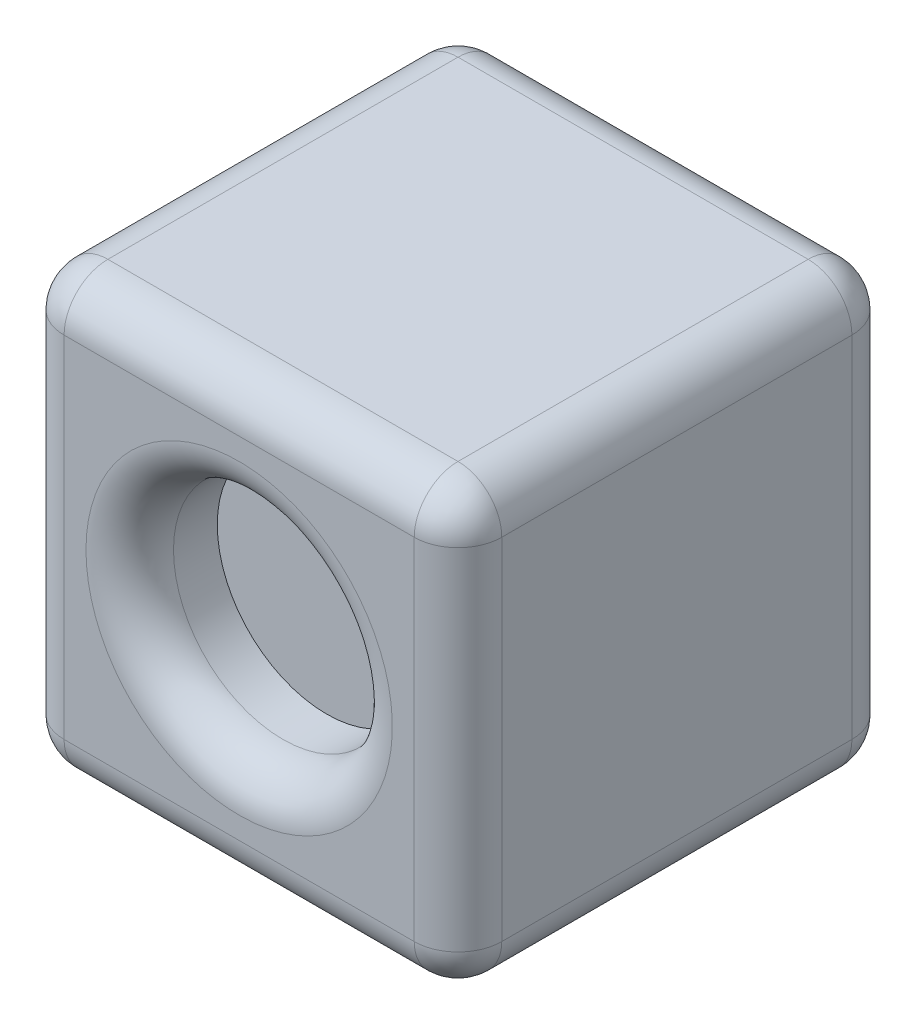
ISO-10303-21;
HEADER;
FILE_DESCRIPTION(('STEP AP214'),'2;1');
FILE_NAME('part.step','',(''),(''),'','','');
FILE_SCHEMA(('AUTOMOTIVE_DESIGN { 1 0 10303 214 1 1 1 1 }'));
ENDSEC;
DATA;
#1=APPLICATION_CONTEXT('core data for automotive mechanical design processes');
#2=APPLICATION_PROTOCOL_DEFINITION('international standard','automotive_design',2000,#1);
#3=PRODUCT_CONTEXT('',#1,'mechanical');
#4=PRODUCT('Part','Part','',(#3));
#5=PRODUCT_RELATED_PRODUCT_CATEGORY('part','',(#4));
#6=PRODUCT_DEFINITION_FORMATION('','',#4);
#7=PRODUCT_DEFINITION_CONTEXT('part definition',#1,'design');
#8=PRODUCT_DEFINITION('design','',#6,#7);
#9=PRODUCT_DEFINITION_SHAPE('','',#8);
#10=(LENGTH_UNIT() NAMED_UNIT(*) SI_UNIT(.MILLI.,.METRE.));
#11=(NAMED_UNIT(*) PLANE_ANGLE_UNIT() SI_UNIT($,.RADIAN.));
#12=(NAMED_UNIT(*) SI_UNIT($,.STERADIAN.) SOLID_ANGLE_UNIT());
#13=UNCERTAINTY_MEASURE_WITH_UNIT(LENGTH_MEASURE(1.E-05),#10,'distance_accuracy_value','');
#14=(GEOMETRIC_REPRESENTATION_CONTEXT(3) GLOBAL_UNCERTAINTY_ASSIGNED_CONTEXT((#13)) GLOBAL_UNIT_ASSIGNED_CONTEXT((#10,
#11,#12)) REPRESENTATION_CONTEXT('',''));
#15=CARTESIAN_POINT('',(0.,0.,0.));
#16=DIRECTION('',(0.,0.,1.));
#17=DIRECTION('',(1.,0.,0.));
#18=AXIS2_PLACEMENT_3D('',#15,#16,#17);
#19=CARTESIAN_POINT('',(50.,-50.,100.));
#20=DIRECTION('',(-1.,0.,0.));
#21=DIRECTION('',(0.,0.,1.));
#22=AXIS2_PLACEMENT_3D('',#19,#20,#21);
#23=PLANE('',#22);
#24=DIRECTION('',(0.,0.,-1.));
#25=VECTOR('',#24,1.);
#26=CARTESIAN_POINT('',(50.,-40.,100.));
#27=LINE('',#26,#25);
#28=CARTESIAN_POINT('',(50.,-40.,90.));
#29=VERTEX_POINT('',#28);
#30=CARTESIAN_POINT('',(50.,-40.,9.99999999999999));
#31=VERTEX_POINT('',#30);
#32=EDGE_CURVE('E363',#29,#31,#27,.T.);
#33=ORIENTED_EDGE('',*,*,#32,.T.);
#34=DIRECTION('',(0.,1.,0.));
#35=VECTOR('',#34,1.);
#36=CARTESIAN_POINT('',(50.,50.,9.99999999999999));
#37=LINE('',#36,#35);
#38=CARTESIAN_POINT('',(50.,40.,9.99999999999999));
#39=VERTEX_POINT('',#38);
#40=EDGE_CURVE('E443',#31,#39,#37,.T.);
#41=ORIENTED_EDGE('',*,*,#40,.T.);
#42=DIRECTION('',(0.,0.,-1.));
#43=VECTOR('',#42,1.);
#44=CARTESIAN_POINT('',(50.,40.,100.));
#45=LINE('',#44,#43);
#46=CARTESIAN_POINT('',(50.,40.,90.));
#47=VERTEX_POINT('',#46);
#48=EDGE_CURVE('E440',#39,#47,#45,.F.);
#49=ORIENTED_EDGE('',*,*,#48,.T.);
#50=DIRECTION('',(0.,1.,0.));
#51=VECTOR('',#50,1.);
#52=CARTESIAN_POINT('',(50.,-50.,90.));
#53=LINE('',#52,#51);
#54=EDGE_CURVE('E437',#47,#29,#53,.F.);
#55=ORIENTED_EDGE('',*,*,#54,.T.);
#56=EDGE_LOOP('',(#33,#41,#49,#55));
#57=FACE_BOUND('',#56,.T.);
#58=ADVANCED_FACE('F46',(#57),#23,.F.);
#59=CARTESIAN_POINT('',(-50.,50.,100.));
#60=DIRECTION('',(0.,-1.,0.));
#61=DIRECTION('',(0.,0.,-1.));
#62=AXIS2_PLACEMENT_3D('',#59,#60,#61);
#63=PLANE('',#62);
#64=DIRECTION('',(0.,0.,-1.));
#65=VECTOR('',#64,1.);
#66=CARTESIAN_POINT('',(40.,50.,100.));
#67=LINE('',#66,#65);
#68=CARTESIAN_POINT('',(40.,50.,90.));
#69=VERTEX_POINT('',#68);
#70=CARTESIAN_POINT('',(40.,50.,9.99999999999999));
#71=VERTEX_POINT('',#70);
#72=EDGE_CURVE('E453',#69,#71,#67,.T.);
#73=ORIENTED_EDGE('',*,*,#72,.T.);
#74=DIRECTION('',(-1.,0.,0.));
#75=VECTOR('',#74,1.);
#76=CARTESIAN_POINT('',(-40.,50.,9.99999999999999));
#77=LINE('',#76,#75);
#78=CARTESIAN_POINT('',(-40.,50.,9.99999999999999));
#79=VERTEX_POINT('',#78);
#80=EDGE_CURVE('E456',#71,#79,#77,.T.);
#81=ORIENTED_EDGE('',*,*,#80,.T.);
#82=DIRECTION('',(0.,0.,-1.));
#83=VECTOR('',#82,1.);
#84=CARTESIAN_POINT('',(-40.,50.,100.));
#85=LINE('',#84,#83);
#86=CARTESIAN_POINT('',(-40.,50.,90.));
#87=VERTEX_POINT('',#86);
#88=EDGE_CURVE('E345',#79,#87,#85,.F.);
#89=ORIENTED_EDGE('',*,*,#88,.T.);
#90=DIRECTION('',(-1.,0.,0.));
#91=VECTOR('',#90,1.);
#92=CARTESIAN_POINT('',(-50.,50.,90.));
#93=LINE('',#92,#91);
#94=EDGE_CURVE('E341',#87,#69,#93,.F.);
#95=ORIENTED_EDGE('',*,*,#94,.T.);
#96=EDGE_LOOP('',(#73,#81,#89,#95));
#97=FACE_BOUND('',#96,.T.);
#98=ADVANCED_FACE('F578',(#97),#63,.F.);
#99=CARTESIAN_POINT('',(-50.,-50.,100.));
#100=DIRECTION('',(1.,0.,0.));
#101=DIRECTION('',(0.,0.,-1.));
#102=AXIS2_PLACEMENT_3D('',#99,#100,#101);
#103=PLANE('',#102);
#104=DIRECTION('',(0.,-1.,0.));
#105=VECTOR('',#104,1.);
#106=CARTESIAN_POINT('',(-50.,-50.,80.9807621135332));
#107=LINE('',#106,#105);
#108=CARTESIAN_POINT('',(-50.,17.8867513459482,80.9807621135332));
#109=VERTEX_POINT('',#108);
#110=CARTESIAN_POINT('',(-50.,-17.8867513459482,80.9807621135332));
#111=VERTEX_POINT('',#110);
#112=EDGE_CURVE('E272',#109,#111,#107,.T.);
#113=ORIENTED_EDGE('',*,*,#112,.T.);
#114=DIRECTION('',(0.,-0.500000000000001,-0.866025403784438));
#115=VECTOR('',#114,1.);
#116=CARTESIAN_POINT('',(-50.,-17.6794919243113,81.3397459621556));
#117=LINE('',#116,#115);
#118=CARTESIAN_POINT('',(-50.,-35.7735026918963,50.));
#119=VERTEX_POINT('',#118);
#120=EDGE_CURVE('E287',#111,#119,#117,.T.);
#121=ORIENTED_EDGE('',*,*,#120,.T.);
#122=DIRECTION('',(0.,0.5,-0.866025403784439));
#123=VECTOR('',#122,1.);
#124=CARTESIAN_POINT('',(-50.,-60.9807621135332,93.6602540378444));
#125=LINE('',#124,#123);
#126=CARTESIAN_POINT('',(-50.,-17.8867513459482,19.0192378864668));
#127=VERTEX_POINT('',#126);
#128=EDGE_CURVE('E284',#119,#127,#125,.T.);
#129=ORIENTED_EDGE('',*,*,#128,.T.);
#130=DIRECTION('',(0.,1.,0.));
#131=VECTOR('',#130,1.);
#132=CARTESIAN_POINT('',(-50.,-50.,19.0192378864668));
#133=LINE('',#132,#131);
#134=CARTESIAN_POINT('',(-50.,17.8867513459482,19.0192378864668));
#135=VERTEX_POINT('',#134);
#136=EDGE_CURVE('E281',#127,#135,#133,.T.);
#137=ORIENTED_EDGE('',*,*,#136,.T.);
#138=DIRECTION('',(0.,0.5,0.866025403784439));
#139=VECTOR('',#138,1.);
#140=CARTESIAN_POINT('',(-50.,35.9807621135332,50.3589838486224));
#141=LINE('',#140,#139);
#142=CARTESIAN_POINT('',(-50.,35.7735026918963,50.));
#143=VERTEX_POINT('',#142);
#144=EDGE_CURVE('E278',#135,#143,#141,.T.);
#145=ORIENTED_EDGE('',*,*,#144,.T.);
#146=DIRECTION('',(0.,-0.499999999999999,0.866025403784439));
#147=VECTOR('',#146,1.);
#148=CARTESIAN_POINT('',(-50.,-7.32050807568863,124.641016151378));
#149=LINE('',#148,#147);
#150=EDGE_CURVE('E275',#143,#109,#149,.T.);
#151=ORIENTED_EDGE('',*,*,#150,.T.);
#152=EDGE_LOOP('',(#113,#121,#129,#137,#145,#151));
#153=FACE_BOUND('',#152,.T.);
#154=DIRECTION('',(0.,0.,-1.));
#155=VECTOR('',#154,1.);
#156=CARTESIAN_POINT('',(-50.,40.,100.));
#157=LINE('',#156,#155);
#158=CARTESIAN_POINT('',(-50.,40.,90.));
#159=VERTEX_POINT('',#158);
#160=CARTESIAN_POINT('',(-50.,40.,9.99999999999999));
#161=VERTEX_POINT('',#160);
#162=EDGE_CURVE('E333',#159,#161,#157,.T.);
#163=ORIENTED_EDGE('',*,*,#162,.T.);
#164=DIRECTION('',(0.,-1.,0.));
#165=VECTOR('',#164,1.);
#166=CARTESIAN_POINT('',(-50.,-40.,9.99999999999999));
#167=LINE('',#166,#165);
#168=CARTESIAN_POINT('',(-50.,-40.,9.99999999999999));
#169=VERTEX_POINT('',#168);
#170=EDGE_CURVE('E416',#161,#169,#167,.T.);
#171=ORIENTED_EDGE('',*,*,#170,.T.);
#172=DIRECTION('',(0.,0.,-1.));
#173=VECTOR('',#172,1.);
#174=CARTESIAN_POINT('',(-50.,-40.,100.));
#175=LINE('',#174,#173);
#176=CARTESIAN_POINT('',(-50.,-40.,90.));
#177=VERTEX_POINT('',#176);
#178=EDGE_CURVE('E327',#169,#177,#175,.F.);
#179=ORIENTED_EDGE('',*,*,#178,.T.);
#180=DIRECTION('',(0.,-1.,0.));
#181=VECTOR('',#180,1.);
#182=CARTESIAN_POINT('',(-50.,-50.,90.));
#183=LINE('',#182,#181);
#184=EDGE_CURVE('E330',#177,#159,#183,.F.);
#185=ORIENTED_EDGE('',*,*,#184,.T.);
#186=EDGE_LOOP('',(#163,#171,#179,#185));
#187=FACE_BOUND('',#186,.T.);
#188=ADVANCED_FACE('F603',(#153,#187),#103,.F.);
#189=CARTESIAN_POINT('',(-50.,-50.,100.));
#190=DIRECTION('',(0.,1.,0.));
#191=DIRECTION('',(0.,0.,1.));
#192=AXIS2_PLACEMENT_3D('',#189,#190,#191);
#193=PLANE('',#192);
#194=DIRECTION('',(0.,0.,-1.));
#195=VECTOR('',#194,1.);
#196=CARTESIAN_POINT('',(-40.,-50.,100.));
#197=LINE('',#196,#195);
#198=CARTESIAN_POINT('',(-40.,-50.,90.));
#199=VERTEX_POINT('',#198);
#200=CARTESIAN_POINT('',(-40.,-50.,9.99999999999999));
#201=VERTEX_POINT('',#200);
#202=EDGE_CURVE('E348',#199,#201,#197,.T.);
#203=ORIENTED_EDGE('',*,*,#202,.T.);
#204=DIRECTION('',(1.,0.,0.));
#205=VECTOR('',#204,1.);
#206=CARTESIAN_POINT('',(50.,-50.,9.99999999999999));
#207=LINE('',#206,#205);
#208=CARTESIAN_POINT('',(40.,-50.,9.99999999999999));
#209=VERTEX_POINT('',#208);
#210=EDGE_CURVE('E359',#201,#209,#207,.T.);
#211=ORIENTED_EDGE('',*,*,#210,.T.);
#212=DIRECTION('',(0.,0.,-1.));
#213=VECTOR('',#212,1.);
#214=CARTESIAN_POINT('',(40.,-50.,100.));
#215=LINE('',#214,#213);
#216=CARTESIAN_POINT('',(40.,-50.,90.));
#217=VERTEX_POINT('',#216);
#218=EDGE_CURVE('E355',#209,#217,#215,.F.);
#219=ORIENTED_EDGE('',*,*,#218,.T.);
#220=DIRECTION('',(1.,0.,0.));
#221=VECTOR('',#220,1.);
#222=CARTESIAN_POINT('',(-50.,-50.,90.));
#223=LINE('',#222,#221);
#224=EDGE_CURVE('E352',#217,#199,#223,.F.);
#225=ORIENTED_EDGE('',*,*,#224,.T.);
#226=EDGE_LOOP('',(#203,#211,#219,#225));
#227=FACE_BOUND('',#226,.T.);
#228=ADVANCED_FACE('F526',(#227),#193,.F.);
#229=CARTESIAN_POINT('',(0.,0.,100.));
#230=DIRECTION('',(0.,0.,-1.));
#231=DIRECTION('',(-1.,0.,0.));
#232=AXIS2_PLACEMENT_3D('',#229,#230,#231);
#233=PLANE('',#232);
#234=CARTESIAN_POINT('',(0.,0.,100.));
#235=DIRECTION('',(0.,0.,-1.));
#236=DIRECTION('',(-1.,0.,0.));
#237=AXIS2_PLACEMENT_3D('',#234,#235,#236);
#238=CIRCLE('',#237,35.);
#239=CARTESIAN_POINT('',(-35.,0.,100.));
#240=VERTEX_POINT('',#239);
#241=EDGE_CURVE('E323',#240,#240,#238,.T.);
#242=ORIENTED_EDGE('',*,*,#241,.T.);
#243=EDGE_LOOP('',(#242));
#244=FACE_BOUND('',#243,.T.);
#245=DIRECTION('',(1.,0.,0.));
#246=VECTOR('',#245,1.);
#247=CARTESIAN_POINT('',(0.,-40.,100.));
#248=LINE('',#247,#246);
#249=CARTESIAN_POINT('',(-40.,-40.,100.));
#250=VERTEX_POINT('',#249);
#251=CARTESIAN_POINT('',(40.,-40.,100.));
#252=VERTEX_POINT('',#251);
#253=EDGE_CURVE('E367',#250,#252,#248,.T.);
#254=ORIENTED_EDGE('',*,*,#253,.T.);
#255=DIRECTION('',(0.,1.,0.));
#256=VECTOR('',#255,1.);
#257=CARTESIAN_POINT('',(40.,0.,100.));
#258=LINE('',#257,#256);
#259=CARTESIAN_POINT('',(40.,40.,100.));
#260=VERTEX_POINT('',#259);
#261=EDGE_CURVE('E459',#252,#260,#258,.T.);
#262=ORIENTED_EDGE('',*,*,#261,.T.);
#263=DIRECTION('',(-1.,0.,0.));
#264=VECTOR('',#263,1.);
#265=CARTESIAN_POINT('',(0.,40.,100.));
#266=LINE('',#265,#264);
#267=CARTESIAN_POINT('',(-40.,40.,100.));
#268=VERTEX_POINT('',#267);
#269=EDGE_CURVE('E374',#260,#268,#266,.T.);
#270=ORIENTED_EDGE('',*,*,#269,.T.);
#271=DIRECTION('',(0.,-1.,0.));
#272=VECTOR('',#271,1.);
#273=CARTESIAN_POINT('',(-40.,0.,100.));
#274=LINE('',#273,#272);
#275=EDGE_CURVE('E371',#268,#250,#274,.T.);
#276=ORIENTED_EDGE('',*,*,#275,.T.);
#277=EDGE_LOOP('',(#254,#262,#270,#276));
#278=FACE_BOUND('',#277,.T.);
#279=ADVANCED_FACE('F1003',(#244,#278),#233,.F.);
#280=CARTESIAN_POINT('',(0.,0.,0.));
#281=DIRECTION('',(0.,0.,-1.));
#282=DIRECTION('',(-1.,0.,0.));
#283=AXIS2_PLACEMENT_3D('',#280,#281,#282);
#284=PLANE('',#283);
#285=DIRECTION('',(1.,0.,0.));
#286=VECTOR('',#285,1.);
#287=CARTESIAN_POINT('',(-50.,-40.,0.));
#288=LINE('',#287,#286);
#289=CARTESIAN_POINT('',(40.,-40.,0.));
#290=VERTEX_POINT('',#289);
#291=CARTESIAN_POINT('',(-40.,-40.,0.));
#292=VERTEX_POINT('',#291);
#293=EDGE_CURVE('E337',#290,#292,#288,.F.);
#294=ORIENTED_EDGE('',*,*,#293,.T.);
#295=DIRECTION('',(0.,-1.,0.));
#296=VECTOR('',#295,1.);
#297=CARTESIAN_POINT('',(-40.,40.,0.));
#298=LINE('',#297,#296);
#299=CARTESIAN_POINT('',(-40.,40.,0.));
#300=VERTEX_POINT('',#299);
#301=EDGE_CURVE('E425',#292,#300,#298,.F.);
#302=ORIENTED_EDGE('',*,*,#301,.T.);
#303=DIRECTION('',(-1.,0.,0.));
#304=VECTOR('',#303,1.);
#305=CARTESIAN_POINT('',(50.,40.,0.));
#306=LINE('',#305,#304);
#307=CARTESIAN_POINT('',(40.,40.,0.));
#308=VERTEX_POINT('',#307);
#309=EDGE_CURVE('E419',#300,#308,#306,.F.);
#310=ORIENTED_EDGE('',*,*,#309,.T.);
#311=DIRECTION('',(0.,1.,0.));
#312=VECTOR('',#311,1.);
#313=CARTESIAN_POINT('',(40.,-40.,0.));
#314=LINE('',#313,#312);
#315=EDGE_CURVE('E422',#308,#290,#314,.F.);
#316=ORIENTED_EDGE('',*,*,#315,.T.);
#317=EDGE_LOOP('',(#294,#302,#310,#316));
#318=FACE_BOUND('',#317,.T.);
#319=ADVANCED_FACE('F553',(#318),#284,.T.);
#320=CARTESIAN_POINT('',(0.,0.,80.));
#321=DIRECTION('',(0.,0.,1.));
#322=DIRECTION('',(1.,0.,0.));
#323=AXIS2_PLACEMENT_3D('',#320,#321,#322);
#324=CYLINDRICAL_SURFACE('',#323,25.);
#325=CARTESIAN_POINT('',(0.,0.,90.));
#326=DIRECTION('',(0.,0.,-1.));
#327=DIRECTION('',(-1.,0.,0.));
#328=AXIS2_PLACEMENT_3D('',#325,#326,#327);
#329=CIRCLE('',#328,25.);
#330=CARTESIAN_POINT('',(-25.,0.,90.));
#331=VERTEX_POINT('',#330);
#332=EDGE_CURVE('E301',#331,#331,#329,.F.);
#333=ORIENTED_EDGE('',*,*,#332,.T.);
#334=EDGE_LOOP('',(#333));
#335=FACE_BOUND('',#334,.T.);
#336=CARTESIAN_POINT('',(0.,0.,80.));
#337=DIRECTION('',(0.,0.,1.));
#338=DIRECTION('',(1.,0.,0.));
#339=AXIS2_PLACEMENT_3D('',#336,#337,#338);
#340=CIRCLE('',#339,25.);
#341=CARTESIAN_POINT('',(25.,0.,80.));
#342=VERTEX_POINT('',#341);
#343=EDGE_CURVE('E252',#342,#342,#340,.T.);
#344=ORIENTED_EDGE('',*,*,#343,.F.);
#345=EDGE_LOOP('',(#344));
#346=FACE_BOUND('',#345,.T.);
#347=ADVANCED_FACE('F987',(#335,#346),#324,.F.);
#348=CARTESIAN_POINT('',(0.,0.,80.));
#349=DIRECTION('',(0.,0.,1.));
#350=DIRECTION('',(1.,0.,0.));
#351=AXIS2_PLACEMENT_3D('',#348,#349,#350);
#352=PLANE('',#351);
#353=ORIENTED_EDGE('',*,*,#343,.T.);
#354=EDGE_LOOP('',(#353));
#355=FACE_BOUND('',#354,.T.);
#356=ADVANCED_FACE('F916',(#355),#352,.T.);
#357=CARTESIAN_POINT('',(-30.,-0.84936490538906,-0.490381056766595));
#358=DIRECTION('',(0.,-0.866025403784439,-0.5));
#359=DIRECTION('',(0.,0.5,-0.866025403784439));
#360=AXIS2_PLACEMENT_3D('',#357,#358,#359);
#361=PLANE('',#360);
#362=DIRECTION('',(-1.,0.,0.));
#363=VECTOR('',#362,1.);
#364=CARTESIAN_POINT('',(-30.,-15.,24.0192378864668));
#365=LINE('',#364,#363);
#366=CARTESIAN_POINT('',(-30.,-15.,24.0192378864668));
#367=VERTEX_POINT('',#366);
#368=CARTESIAN_POINT('',(-45.,-15.,24.0192378864668));
#369=VERTEX_POINT('',#368);
#370=EDGE_CURVE('E249',#367,#369,#365,.T.);
#371=ORIENTED_EDGE('',*,*,#370,.T.);
#372=DIRECTION('',(0.,-0.5,0.866025403784439));
#373=VECTOR('',#372,1.);
#374=CARTESIAN_POINT('',(-45.,-0.84936490538906,-0.490381056766595));
#375=LINE('',#374,#373);
#376=CARTESIAN_POINT('',(-45.,-30.,50.));
#377=VERTEX_POINT('',#376);
#378=EDGE_CURVE('E211',#369,#377,#375,.T.);
#379=ORIENTED_EDGE('',*,*,#378,.T.);
#380=DIRECTION('',(-1.,0.,0.));
#381=VECTOR('',#380,1.);
#382=CARTESIAN_POINT('',(-30.,-30.,50.));
#383=LINE('',#382,#381);
#384=CARTESIAN_POINT('',(-30.,-30.,50.));
#385=VERTEX_POINT('',#384);
#386=EDGE_CURVE('E203',#385,#377,#383,.T.);
#387=ORIENTED_EDGE('',*,*,#386,.F.);
#388=DIRECTION('',(0.,-0.5,0.866025403784439));
#389=VECTOR('',#388,1.);
#390=CARTESIAN_POINT('',(-30.,-0.84936490538906,-0.490381056766595));
#391=LINE('',#390,#389);
#392=EDGE_CURVE('E208',#367,#385,#391,.T.);
#393=ORIENTED_EDGE('',*,*,#392,.F.);
#394=EDGE_LOOP('',(#371,#379,#387,#393));
#395=FACE_BOUND('',#394,.T.);
#396=ADVANCED_FACE('F206',(#395),#361,.F.);
#397=CARTESIAN_POINT('',(-30.,0.,24.0192378864668));
#398=DIRECTION('',(0.,0.,-1.));
#399=DIRECTION('',(-1.,0.,0.));
#400=AXIS2_PLACEMENT_3D('',#397,#398,#399);
#401=PLANE('',#400);
#402=DIRECTION('',(-1.,0.,0.));
#403=VECTOR('',#402,1.);
#404=CARTESIAN_POINT('',(-30.,15.,24.0192378864668));
#405=LINE('',#404,#403);
#406=CARTESIAN_POINT('',(-30.,15.,24.0192378864668));
#407=VERTEX_POINT('',#406);
#408=CARTESIAN_POINT('',(-45.,15.,24.0192378864668));
#409=VERTEX_POINT('',#408);
#410=EDGE_CURVE('E253',#407,#409,#405,.T.);
#411=ORIENTED_EDGE('',*,*,#410,.T.);
#412=DIRECTION('',(0.,-1.,0.));
#413=VECTOR('',#412,1.);
#414=CARTESIAN_POINT('',(-45.,0.,24.0192378864668));
#415=LINE('',#414,#413);
#416=EDGE_CURVE('E293',#409,#369,#415,.T.);
#417=ORIENTED_EDGE('',*,*,#416,.T.);
#418=ORIENTED_EDGE('',*,*,#370,.F.);
#419=DIRECTION('',(0.,-1.,0.));
#420=VECTOR('',#419,1.);
#421=CARTESIAN_POINT('',(-30.,0.,24.0192378864668));
#422=LINE('',#421,#420);
#423=EDGE_CURVE('E215',#407,#367,#422,.T.);
#424=ORIENTED_EDGE('',*,*,#423,.F.);
#425=EDGE_LOOP('',(#411,#417,#418,#424));
#426=FACE_BOUND('',#425,.T.);
#427=ADVANCED_FACE('F924',(#426),#401,.F.);
#428=CARTESIAN_POINT('',(-30.,0.849364905389051,-0.49038105676659));
#429=DIRECTION('',(0.,0.866025403784438,-0.5));
#430=DIRECTION('',(0.,0.5,0.866025403784438));
#431=AXIS2_PLACEMENT_3D('',#428,#429,#430);
#432=PLANE('',#431);
#433=DIRECTION('',(-1.,0.,0.));
#434=VECTOR('',#433,1.);
#435=CARTESIAN_POINT('',(-30.,30.,50.));
#436=LINE('',#435,#434);
#437=CARTESIAN_POINT('',(-30.,30.,50.));
#438=VERTEX_POINT('',#437);
#439=CARTESIAN_POINT('',(-45.,30.,50.));
#440=VERTEX_POINT('',#439);
#441=EDGE_CURVE('E257',#438,#440,#436,.T.);
#442=ORIENTED_EDGE('',*,*,#441,.T.);
#443=DIRECTION('',(0.,-0.5,-0.866025403784438));
#444=VECTOR('',#443,1.);
#445=CARTESIAN_POINT('',(-45.,0.849364905389051,-0.49038105676659));
#446=LINE('',#445,#444);
#447=EDGE_CURVE('E296',#440,#409,#446,.T.);
#448=ORIENTED_EDGE('',*,*,#447,.T.);
#449=ORIENTED_EDGE('',*,*,#410,.F.);
#450=DIRECTION('',(0.,-0.5,-0.866025403784439));
#451=VECTOR('',#450,1.);
#452=CARTESIAN_POINT('',(-30.,0.849364905389051,-0.49038105676659));
#453=LINE('',#452,#451);
#454=EDGE_CURVE('E244',#438,#407,#453,.T.);
#455=ORIENTED_EDGE('',*,*,#454,.F.);
#456=EDGE_LOOP('',(#442,#448,#449,#455));
#457=FACE_BOUND('',#456,.T.);
#458=ADVANCED_FACE('F933',(#457),#432,.F.);
#459=CARTESIAN_POINT('',(-30.,44.150635094611,25.4903810567665));
#460=DIRECTION('',(0.,0.866025403784439,0.499999999999999));
#461=DIRECTION('',(0.,-0.499999999999999,0.866025403784439));
#462=AXIS2_PLACEMENT_3D('',#459,#460,#461);
#463=PLANE('',#462);
#464=DIRECTION('',(-1.,0.,0.));
#465=VECTOR('',#464,1.);
#466=CARTESIAN_POINT('',(-30.,15.,75.9807621135332));
#467=LINE('',#466,#465);
#468=CARTESIAN_POINT('',(-30.,15.,75.9807621135332));
#469=VERTEX_POINT('',#468);
#470=CARTESIAN_POINT('',(-40.857864376269,15.,75.9807621135332));
#471=VERTEX_POINT('',#470);
#472=EDGE_CURVE('E261',#469,#471,#467,.T.);
#473=ORIENTED_EDGE('',*,*,#472,.T.);
#474=CARTESIAN_POINT('',(-40.857864376269,9.22649730810378,85.9807621135332));
#475=DIRECTION('',(0.,0.866025403784439,0.499999999999999));
#476=DIRECTION('',(0.,0.499999999999999,-0.866025403784439));
#477=AXIS2_PLACEMENT_3D('',#474,#475,#476);
#478=ELLIPSE('',#477,11.5470053837925,10.);
#479=CARTESIAN_POINT('',(-45.,14.4814223781252,76.8789649022887));
#480=VERTEX_POINT('',#479);
#481=EDGE_CURVE('E462',#471,#480,#478,.T.);
#482=ORIENTED_EDGE('',*,*,#481,.T.);
#483=DIRECTION('',(0.,0.499999999999999,-0.866025403784439));
#484=VECTOR('',#483,1.);
#485=CARTESIAN_POINT('',(-45.,44.150635094611,25.4903810567665));
#486=LINE('',#485,#484);
#487=EDGE_CURVE('E71',#480,#440,#486,.T.);
#488=ORIENTED_EDGE('',*,*,#487,.T.);
#489=ORIENTED_EDGE('',*,*,#441,.F.);
#490=DIRECTION('',(0.,0.499999999999999,-0.866025403784439));
#491=VECTOR('',#490,1.);
#492=CARTESIAN_POINT('',(-30.,44.150635094611,25.4903810567665));
#493=LINE('',#492,#491);
#494=EDGE_CURVE('E240',#469,#438,#493,.T.);
#495=ORIENTED_EDGE('',*,*,#494,.F.);
#496=EDGE_LOOP('',(#473,#482,#488,#489,#495));
#497=FACE_BOUND('',#496,.T.);
#498=ADVANCED_FACE('F943',(#497),#463,.F.);
#499=CARTESIAN_POINT('',(-30.,0.,75.9807621135332));
#500=DIRECTION('',(0.,0.,1.));
#501=DIRECTION('',(0.,-1.,0.));
#502=AXIS2_PLACEMENT_3D('',#499,#500,#501);
#503=PLANE('',#502);
#504=DIRECTION('',(-1.,0.,0.));
#505=VECTOR('',#504,1.);
#506=CARTESIAN_POINT('',(-30.,-15.,75.9807621135332));
#507=LINE('',#506,#505);
#508=CARTESIAN_POINT('',(-30.,-15.,75.9807621135332));
#509=VERTEX_POINT('',#508);
#510=CARTESIAN_POINT('',(-40.857864376269,-15.,75.9807621135332));
#511=VERTEX_POINT('',#510);
#512=EDGE_CURVE('E214',#509,#511,#507,.T.);
#513=ORIENTED_EDGE('',*,*,#512,.T.);
#514=DIRECTION('',(0.,-1.,0.));
#515=VECTOR('',#514,1.);
#516=CARTESIAN_POINT('',(-40.857864376269,15.,75.9807621135332));
#517=LINE('',#516,#515);
#518=EDGE_CURVE('E446',#511,#471,#517,.F.);
#519=ORIENTED_EDGE('',*,*,#518,.T.);
#520=ORIENTED_EDGE('',*,*,#472,.F.);
#521=DIRECTION('',(0.,1.,0.));
#522=VECTOR('',#521,1.);
#523=CARTESIAN_POINT('',(-30.,0.,75.9807621135332));
#524=LINE('',#523,#522);
#525=EDGE_CURVE('E225',#509,#469,#524,.T.);
#526=ORIENTED_EDGE('',*,*,#525,.F.);
#527=EDGE_LOOP('',(#513,#519,#520,#526));
#528=FACE_BOUND('',#527,.T.);
#529=ADVANCED_FACE('F955',(#528),#503,.F.);
#530=CARTESIAN_POINT('',(-30.,-44.150635094611,25.4903810567667));
#531=DIRECTION('',(0.,-0.866025403784438,0.500000000000001));
#532=DIRECTION('',(0.,-0.500000000000001,-0.866025403784438));
#533=AXIS2_PLACEMENT_3D('',#530,#531,#532);
#534=PLANE('',#533);
#535=ORIENTED_EDGE('',*,*,#386,.T.);
#536=DIRECTION('',(0.,0.500000000000001,0.866025403784438));
#537=VECTOR('',#536,1.);
#538=CARTESIAN_POINT('',(-45.,-44.150635094611,25.4903810567667));
#539=LINE('',#538,#537);
#540=CARTESIAN_POINT('',(-45.,-14.4814223781252,76.8789649022886));
#541=VERTEX_POINT('',#540);
#542=EDGE_CURVE('E63',#377,#541,#539,.T.);
#543=ORIENTED_EDGE('',*,*,#542,.T.);
#544=CARTESIAN_POINT('',(-40.857864376269,-9.22649730810374,85.9807621135332));
#545=DIRECTION('',(0.,-0.866025403784438,0.500000000000001));
#546=DIRECTION('',(0.,0.500000000000001,0.866025403784438));
#547=AXIS2_PLACEMENT_3D('',#544,#545,#546);
#548=ELLIPSE('',#547,11.5470053837925,10.);
#549=EDGE_CURVE('E11',#541,#511,#548,.T.);
#550=ORIENTED_EDGE('',*,*,#549,.T.);
#551=ORIENTED_EDGE('',*,*,#512,.F.);
#552=DIRECTION('',(0.,0.500000000000001,0.866025403784438));
#553=VECTOR('',#552,1.);
#554=CARTESIAN_POINT('',(-30.,-44.150635094611,25.4903810567667));
#555=LINE('',#554,#553);
#556=EDGE_CURVE('E218',#385,#509,#555,.T.);
#557=ORIENTED_EDGE('',*,*,#556,.F.);
#558=EDGE_LOOP('',(#535,#543,#550,#551,#557));
#559=FACE_BOUND('',#558,.T.);
#560=ADVANCED_FACE('F219',(#559),#534,.F.);
#561=CARTESIAN_POINT('',(-30.,0.,0.));
#562=DIRECTION('',(-1.,0.,0.));
#563=DIRECTION('',(0.,0.,1.));
#564=AXIS2_PLACEMENT_3D('',#561,#562,#563);
#565=PLANE('',#564);
#566=ORIENTED_EDGE('',*,*,#392,.T.);
#567=ORIENTED_EDGE('',*,*,#556,.T.);
#568=ORIENTED_EDGE('',*,*,#525,.T.);
#569=ORIENTED_EDGE('',*,*,#494,.T.);
#570=ORIENTED_EDGE('',*,*,#454,.T.);
#571=ORIENTED_EDGE('',*,*,#423,.T.);
#572=EDGE_LOOP('',(#566,#567,#568,#569,#570,#571));
#573=FACE_BOUND('',#572,.T.);
#574=ADVANCED_FACE('F227',(#573),#565,.T.);
#575=CARTESIAN_POINT('',(-45.,0.849364905389051,-0.49038105676659));
#576=DIRECTION('',(0.707106781186549,0.612372435695793,-0.353553390593273));
#577=DIRECTION('',(0.,-0.5,-0.866025403784438));
#578=AXIS2_PLACEMENT_3D('',#575,#576,#577);
#579=PLANE('',#578);
#580=DIRECTION('',(0.654653670707976,-0.755928946018456,0.));
#581=VECTOR('',#580,1.);
#582=CARTESIAN_POINT('',(-30.5741768409238,13.3424942316509,50.));
#583=LINE('',#582,#581);
#584=EDGE_CURVE('E235',#143,#440,#583,.T.);
#585=ORIENTED_EDGE('',*,*,#584,.F.);
#586=ORIENTED_EDGE('',*,*,#144,.F.);
#587=DIRECTION('',(0.654653670707976,-0.377964473009228,0.654653670707978));
#588=VECTOR('',#587,1.);
#589=CARTESIAN_POINT('',(-41.2884625552095,12.8571428571429,27.7307753312573));
#590=LINE('',#589,#588);
#591=EDGE_CURVE('E231',#409,#135,#590,.F.);
#592=ORIENTED_EDGE('',*,*,#591,.F.);
#593=ORIENTED_EDGE('',*,*,#447,.F.);
#594=EDGE_LOOP('',(#585,#586,#592,#593));
#595=FACE_BOUND('',#594,.T.);
#596=ADVANCED_FACE('F642',(#595),#579,.F.);
#597=CARTESIAN_POINT('',(-45.,0.,24.0192378864668));
#598=DIRECTION('',(0.707106781186549,0.,-0.707106781186546));
#599=DIRECTION('',(0.,-1.,0.));
#600=AXIS2_PLACEMENT_3D('',#597,#598,#599);
#601=PLANE('',#600);
#602=ORIENTED_EDGE('',*,*,#591,.T.);
#603=ORIENTED_EDGE('',*,*,#136,.F.);
#604=DIRECTION('',(0.654653670707976,0.377964473009227,0.654653670707979));
#605=VECTOR('',#604,1.);
#606=CARTESIAN_POINT('',(-52.0027482694952,-19.0430385984603,17.0164896169715));
#607=LINE('',#606,#605);
#608=EDGE_CURVE('E314',#369,#127,#607,.F.);
#609=ORIENTED_EDGE('',*,*,#608,.F.);
#610=ORIENTED_EDGE('',*,*,#416,.F.);
#611=EDGE_LOOP('',(#602,#603,#609,#610));
#612=FACE_BOUND('',#611,.T.);
#613=ADVANCED_FACE('F636',(#612),#601,.F.);
#614=CARTESIAN_POINT('',(-45.,44.150635094611,25.4903810567665));
#615=DIRECTION('',(0.707106781186549,0.612372435695794,0.353553390593272));
#616=DIRECTION('',(0.,0.499999999999999,-0.866025403784439));
#617=AXIS2_PLACEMENT_3D('',#614,#615,#616);
#618=PLANE('',#617);
#619=ORIENTED_EDGE('',*,*,#584,.T.);
#620=ORIENTED_EDGE('',*,*,#487,.F.);
#621=CARTESIAN_POINT('',(-40.857864376269,4.44357107334175,85.9807621135332));
#622=DIRECTION('',(0.707106781186549,0.612372435695794,0.353553390593272));
#623=DIRECTION('',(-0.547722557505166,0.790569415042096,-0.273861278752581));
#624=AXIS2_PLACEMENT_3D('',#621,#622,#623);
#625=ELLIPSE('',#624,16.3299316185545,10.);
#626=CARTESIAN_POINT('',(-47.9289321881345,16.6910197872576,78.9096943016677));
#627=VERTEX_POINT('',#626);
#628=EDGE_CURVE('E465',#480,#627,#625,.T.);
#629=ORIENTED_EDGE('',*,*,#628,.T.);
#630=DIRECTION('',(0.654653670707976,-0.377964473009229,-0.654653670707977));
#631=VECTOR('',#630,1.);
#632=CARTESIAN_POINT('',(-30.5741768409238,6.6712471158254,61.554938954457));
#633=LINE('',#632,#631);
#634=EDGE_CURVE('E310',#109,#627,#633,.T.);
#635=ORIENTED_EDGE('',*,*,#634,.F.);
#636=ORIENTED_EDGE('',*,*,#150,.F.);
#637=EDGE_LOOP('',(#619,#620,#629,#635,#636));
#638=FACE_BOUND('',#637,.T.);
#639=ADVANCED_FACE('F629',(#638),#618,.F.);
#640=CARTESIAN_POINT('',(-45.,-0.84936490538906,-0.490381056766595));
#641=DIRECTION('',(0.707106781186548,-0.612372435695794,-0.353553390593273));
#642=DIRECTION('',(0.,-0.5,0.866025403784439));
#643=AXIS2_PLACEMENT_3D('',#640,#641,#642);
#644=PLANE('',#643);
#645=ORIENTED_EDGE('',*,*,#608,.T.);
#646=ORIENTED_EDGE('',*,*,#128,.F.);
#647=DIRECTION('',(0.654653670707976,0.755928946018456,0.));
#648=VECTOR('',#647,1.);
#649=CARTESIAN_POINT('',(-52.0027482694952,-38.0860771969206,50.));
#650=LINE('',#649,#648);
#651=EDGE_CURVE('E306',#377,#119,#650,.F.);
#652=ORIENTED_EDGE('',*,*,#651,.F.);
#653=ORIENTED_EDGE('',*,*,#378,.F.);
#654=EDGE_LOOP('',(#645,#646,#652,#653));
#655=FACE_BOUND('',#654,.T.);
#656=ADVANCED_FACE('F622',(#655),#644,.F.);
#657=CARTESIAN_POINT('',(-45.,0.,75.9807621135332));
#658=DIRECTION('',(0.707106781186548,0.,0.707106781186547));
#659=DIRECTION('',(0.,1.,0.));
#660=AXIS2_PLACEMENT_3D('',#657,#658,#659);
#661=PLANE('',#660);
#662=ORIENTED_EDGE('',*,*,#634,.T.);
#663=DIRECTION('',(0.,1.,0.));
#664=VECTOR('',#663,1.);
#665=CARTESIAN_POINT('',(-47.9289321881345,-15.,78.9096943016677));
#666=LINE('',#665,#664);
#667=CARTESIAN_POINT('',(-47.9289321881345,-16.6910197872576,78.9096943016677));
#668=VERTEX_POINT('',#667);
#669=EDGE_CURVE('E450',#627,#668,#666,.F.);
#670=ORIENTED_EDGE('',*,*,#669,.T.);
#671=DIRECTION('',(-0.654653670707976,-0.377964473009228,0.654653670707978));
#672=VECTOR('',#671,1.);
#673=CARTESIAN_POINT('',(-30.5741768409239,-6.67124711582546,61.554938954457));
#674=LINE('',#673,#672);
#675=EDGE_CURVE('E302',#111,#668,#674,.F.);
#676=ORIENTED_EDGE('',*,*,#675,.F.);
#677=ORIENTED_EDGE('',*,*,#112,.F.);
#678=EDGE_LOOP('',(#662,#670,#676,#677));
#679=FACE_BOUND('',#678,.T.);
#680=ADVANCED_FACE('F615',(#679),#661,.F.);
#681=CARTESIAN_POINT('',(-45.,-44.150635094611,25.4903810567667));
#682=DIRECTION('',(0.707106781186549,-0.612372435695793,0.353553390593274));
#683=DIRECTION('',(0.,0.500000000000001,0.866025403784438));
#684=AXIS2_PLACEMENT_3D('',#681,#682,#683);
#685=PLANE('',#684);
#686=ORIENTED_EDGE('',*,*,#651,.T.);
#687=ORIENTED_EDGE('',*,*,#120,.F.);
#688=ORIENTED_EDGE('',*,*,#675,.T.);
#689=CARTESIAN_POINT('',(-40.857864376269,-4.44357107334171,85.9807621135332));
#690=DIRECTION('',(0.707106781186549,-0.612372435695793,0.353553390593274));
#691=DIRECTION('',(0.547722557505165,0.790569415042096,0.273861278752583));
#692=AXIS2_PLACEMENT_3D('',#689,#690,#691);
#693=ELLIPSE('',#692,16.3299316185546,10.);
#694=EDGE_CURVE('E56',#668,#541,#693,.T.);
#695=ORIENTED_EDGE('',*,*,#694,.T.);
#696=ORIENTED_EDGE('',*,*,#542,.F.);
#697=EDGE_LOOP('',(#686,#687,#688,#695,#696));
#698=FACE_BOUND('',#697,.T.);
#699=ADVANCED_FACE('F608',(#698),#685,.F.);
#700=CARTESIAN_POINT('',(0.,0.,90.));
#701=DIRECTION('',(0.,0.,-1.));
#702=DIRECTION('',(-1.,0.,0.));
#703=AXIS2_PLACEMENT_3D('',#700,#701,#702);
#704=TOROIDAL_SURFACE('',#703,35.,10.);
#705=ORIENTED_EDGE('',*,*,#241,.F.);
#706=EDGE_LOOP('',(#705));
#707=FACE_BOUND('',#706,.T.);
#708=ORIENTED_EDGE('',*,*,#332,.F.);
#709=EDGE_LOOP('',(#708));
#710=FACE_BOUND('',#709,.T.);
#711=ADVANCED_FACE('F614',(#707,#710),#704,.T.);
#712=CARTESIAN_POINT('',(40.,-40.,100.));
#713=DIRECTION('',(0.,0.,-1.));
#714=DIRECTION('',(-1.,0.,0.));
#715=AXIS2_PLACEMENT_3D('',#712,#713,#714);
#716=CYLINDRICAL_SURFACE('',#715,10.);
#717=ORIENTED_EDGE('',*,*,#218,.F.);
#718=CARTESIAN_POINT('',(40.,-40.,9.99999999999999));
#719=DIRECTION('',(0.,0.,-1.));
#720=DIRECTION('',(-1.,0.,0.));
#721=AXIS2_PLACEMENT_3D('',#718,#719,#720);
#722=CIRCLE('',#721,10.);
#723=EDGE_CURVE('E410',#209,#31,#722,.F.);
#724=ORIENTED_EDGE('',*,*,#723,.T.);
#725=ORIENTED_EDGE('',*,*,#32,.F.);
#726=CARTESIAN_POINT('',(40.,-40.,90.));
#727=DIRECTION('',(0.,0.,-1.));
#728=DIRECTION('',(-1.,0.,0.));
#729=AXIS2_PLACEMENT_3D('',#726,#727,#728);
#730=CIRCLE('',#729,10.);
#731=EDGE_CURVE('E407',#29,#217,#730,.T.);
#732=ORIENTED_EDGE('',*,*,#731,.T.);
#733=EDGE_LOOP('',(#717,#724,#725,#732));
#734=FACE_BOUND('',#733,.T.);
#735=ADVANCED_FACE('F523',(#734),#716,.T.);
#736=CARTESIAN_POINT('',(-50.,-40.,9.99999999999999));
#737=DIRECTION('',(-1.,0.,0.));
#738=DIRECTION('',(0.,0.,1.));
#739=AXIS2_PLACEMENT_3D('',#736,#737,#738);
#740=CYLINDRICAL_SURFACE('',#739,10.);
#741=ORIENTED_EDGE('',*,*,#293,.F.);
#742=CARTESIAN_POINT('',(40.,-40.,9.99999999999999));
#743=DIRECTION('',(-1.,0.,0.));
#744=DIRECTION('',(0.,0.,1.));
#745=AXIS2_PLACEMENT_3D('',#742,#743,#744);
#746=CIRCLE('',#745,10.);
#747=EDGE_CURVE('E403',#290,#209,#746,.T.);
#748=ORIENTED_EDGE('',*,*,#747,.T.);
#749=ORIENTED_EDGE('',*,*,#210,.F.);
#750=CARTESIAN_POINT('',(-40.,-40.,9.99999999999999));
#751=DIRECTION('',(-1.,0.,0.));
#752=DIRECTION('',(0.,0.,1.));
#753=AXIS2_PLACEMENT_3D('',#750,#751,#752);
#754=CIRCLE('',#753,10.);
#755=EDGE_CURVE('E377',#201,#292,#754,.F.);
#756=ORIENTED_EDGE('',*,*,#755,.T.);
#757=EDGE_LOOP('',(#741,#748,#749,#756));
#758=FACE_BOUND('',#757,.T.);
#759=ADVANCED_FACE('F545',(#758),#740,.T.);
#760=CARTESIAN_POINT('',(0.,-40.,90.));
#761=DIRECTION('',(1.,0.,0.));
#762=DIRECTION('',(0.,0.,-1.));
#763=AXIS2_PLACEMENT_3D('',#760,#761,#762);
#764=CYLINDRICAL_SURFACE('',#763,10.);
#765=ORIENTED_EDGE('',*,*,#224,.F.);
#766=CARTESIAN_POINT('',(40.,-40.,90.));
#767=DIRECTION('',(1.,0.,0.));
#768=DIRECTION('',(0.,0.,-1.));
#769=AXIS2_PLACEMENT_3D('',#766,#767,#768);
#770=CIRCLE('',#769,10.);
#771=EDGE_CURVE('E431',#217,#252,#770,.F.);
#772=ORIENTED_EDGE('',*,*,#771,.T.);
#773=ORIENTED_EDGE('',*,*,#253,.F.);
#774=CARTESIAN_POINT('',(-40.,-40.,90.));
#775=DIRECTION('',(-1.,0.,0.));
#776=DIRECTION('',(0.,0.,1.));
#777=AXIS2_PLACEMENT_3D('',#774,#775,#776);
#778=CIRCLE('',#777,10.);
#779=EDGE_CURVE('E307',#199,#250,#778,.T.);
#780=ORIENTED_EDGE('',*,*,#779,.F.);
#781=EDGE_LOOP('',(#765,#772,#773,#780));
#782=FACE_BOUND('',#781,.T.);
#783=ADVANCED_FACE('F531',(#782),#764,.T.);
#784=CARTESIAN_POINT('',(-40.,-40.,100.));
#785=DIRECTION('',(0.,0.,-1.));
#786=DIRECTION('',(-1.,0.,0.));
#787=AXIS2_PLACEMENT_3D('',#784,#785,#786);
#788=CYLINDRICAL_SURFACE('',#787,10.);
#789=ORIENTED_EDGE('',*,*,#178,.F.);
#790=CARTESIAN_POINT('',(-40.,-40.,9.99999999999999));
#791=DIRECTION('',(0.,0.,-1.));
#792=DIRECTION('',(-1.,0.,0.));
#793=AXIS2_PLACEMENT_3D('',#790,#791,#792);
#794=CIRCLE('',#793,10.);
#795=EDGE_CURVE('E413',#169,#201,#794,.F.);
#796=ORIENTED_EDGE('',*,*,#795,.T.);
#797=ORIENTED_EDGE('',*,*,#202,.F.);
#798=CARTESIAN_POINT('',(-40.,-40.,90.));
#799=DIRECTION('',(0.,0.,1.));
#800=DIRECTION('',(1.,0.,0.));
#801=AXIS2_PLACEMENT_3D('',#798,#799,#800);
#802=CIRCLE('',#801,10.);
#803=EDGE_CURVE('E394',#177,#199,#802,.T.);
#804=ORIENTED_EDGE('',*,*,#803,.F.);
#805=EDGE_LOOP('',(#789,#796,#797,#804));
#806=FACE_BOUND('',#805,.T.);
#807=ADVANCED_FACE('F540',(#806),#788,.T.);
#808=CARTESIAN_POINT('',(-40.,-40.,90.));
#809=DIRECTION('',(0.,-1.,0.));
#810=DIRECTION('',(0.,0.,-1.));
#811=AXIS2_PLACEMENT_3D('',#808,#809,#810);
#812=SPHERICAL_SURFACE('',#811,10.);
#813=ORIENTED_EDGE('',*,*,#803,.T.);
#814=ORIENTED_EDGE('',*,*,#779,.T.);
#815=CARTESIAN_POINT('',(-40.,-40.,90.));
#816=DIRECTION('',(0.,-1.,0.));
#817=DIRECTION('',(0.,0.,-1.));
#818=AXIS2_PLACEMENT_3D('',#815,#816,#817);
#819=CIRCLE('',#818,10.);
#820=EDGE_CURVE('E390',#177,#250,#819,.F.);
#821=ORIENTED_EDGE('',*,*,#820,.F.);
#822=EDGE_LOOP('',(#813,#814,#821));
#823=FACE_BOUND('',#822,.T.);
#824=ADVANCED_FACE('F536',(#823),#812,.T.);
#825=CARTESIAN_POINT('',(0.,40.,90.));
#826=DIRECTION('',(-1.,0.,0.));
#827=DIRECTION('',(0.,0.,1.));
#828=AXIS2_PLACEMENT_3D('',#825,#826,#827);
#829=CYLINDRICAL_SURFACE('',#828,10.);
#830=ORIENTED_EDGE('',*,*,#269,.F.);
#831=CARTESIAN_POINT('',(40.,40.,90.));
#832=DIRECTION('',(-1.,0.,0.));
#833=DIRECTION('',(0.,0.,1.));
#834=AXIS2_PLACEMENT_3D('',#831,#832,#833);
#835=CIRCLE('',#834,10.);
#836=EDGE_CURVE('E434',#260,#69,#835,.T.);
#837=ORIENTED_EDGE('',*,*,#836,.T.);
#838=ORIENTED_EDGE('',*,*,#94,.F.);
#839=CARTESIAN_POINT('',(-40.,40.,90.));
#840=DIRECTION('',(-1.,0.,0.));
#841=DIRECTION('',(0.,0.,1.));
#842=AXIS2_PLACEMENT_3D('',#839,#840,#841);
#843=CIRCLE('',#842,10.);
#844=EDGE_CURVE('E386',#268,#87,#843,.T.);
#845=ORIENTED_EDGE('',*,*,#844,.F.);
#846=EDGE_LOOP('',(#830,#837,#838,#845));
#847=FACE_BOUND('',#846,.T.);
#848=ADVANCED_FACE('F661',(#847),#829,.T.);
#849=CARTESIAN_POINT('',(-40.,0.,90.));
#850=DIRECTION('',(0.,-1.,0.));
#851=DIRECTION('',(0.,0.,-1.));
#852=AXIS2_PLACEMENT_3D('',#849,#850,#851);
#853=CYLINDRICAL_SURFACE('',#852,10.);
#854=ORIENTED_EDGE('',*,*,#820,.T.);
#855=ORIENTED_EDGE('',*,*,#275,.F.);
#856=CARTESIAN_POINT('',(-40.,40.,90.));
#857=DIRECTION('',(0.,1.,0.));
#858=DIRECTION('',(0.,0.,1.));
#859=AXIS2_PLACEMENT_3D('',#856,#857,#858);
#860=CIRCLE('',#859,10.);
#861=EDGE_CURVE('E382',#159,#268,#860,.T.);
#862=ORIENTED_EDGE('',*,*,#861,.F.);
#863=ORIENTED_EDGE('',*,*,#184,.F.);
#864=EDGE_LOOP('',(#854,#855,#862,#863));
#865=FACE_BOUND('',#864,.T.);
#866=ADVANCED_FACE('F657',(#865),#853,.T.);
#867=CARTESIAN_POINT('',(-40.,40.,90.));
#868=DIRECTION('',(0.,0.,1.));
#869=DIRECTION('',(1.,0.,0.));
#870=AXIS2_PLACEMENT_3D('',#867,#868,#869);
#871=SPHERICAL_SURFACE('',#870,10.);
#872=ORIENTED_EDGE('',*,*,#861,.T.);
#873=ORIENTED_EDGE('',*,*,#844,.T.);
#874=CARTESIAN_POINT('',(-40.,40.,90.));
#875=DIRECTION('',(0.,0.,1.));
#876=DIRECTION('',(1.,0.,0.));
#877=AXIS2_PLACEMENT_3D('',#874,#875,#876);
#878=CIRCLE('',#877,10.);
#879=EDGE_CURVE('E378',#159,#87,#878,.F.);
#880=ORIENTED_EDGE('',*,*,#879,.F.);
#881=EDGE_LOOP('',(#872,#873,#880));
#882=FACE_BOUND('',#881,.T.);
#883=ADVANCED_FACE('F654',(#882),#871,.T.);
#884=CARTESIAN_POINT('',(-40.,40.,100.));
#885=DIRECTION('',(0.,0.,-1.));
#886=DIRECTION('',(-1.,0.,0.));
#887=AXIS2_PLACEMENT_3D('',#884,#885,#886);
#888=CYLINDRICAL_SURFACE('',#887,10.);
#889=ORIENTED_EDGE('',*,*,#88,.F.);
#890=CARTESIAN_POINT('',(-40.,40.,9.99999999999999));
#891=DIRECTION('',(0.,0.,-1.));
#892=DIRECTION('',(-1.,0.,0.));
#893=AXIS2_PLACEMENT_3D('',#890,#891,#892);
#894=CIRCLE('',#893,10.);
#895=EDGE_CURVE('E428',#79,#161,#894,.F.);
#896=ORIENTED_EDGE('',*,*,#895,.T.);
#897=ORIENTED_EDGE('',*,*,#162,.F.);
#898=ORIENTED_EDGE('',*,*,#879,.T.);
#899=EDGE_LOOP('',(#889,#896,#897,#898));
#900=FACE_BOUND('',#899,.T.);
#901=ADVANCED_FACE('F582',(#900),#888,.T.);
#902=CARTESIAN_POINT('',(40.,-40.,90.));
#903=DIRECTION('',(0.,0.,1.));
#904=DIRECTION('',(1.,0.,0.));
#905=AXIS2_PLACEMENT_3D('',#902,#903,#904);
#906=SPHERICAL_SURFACE('',#905,10.);
#907=ORIENTED_EDGE('',*,*,#771,.F.);
#908=ORIENTED_EDGE('',*,*,#731,.F.);
#909=CARTESIAN_POINT('',(40.,-40.,90.));
#910=DIRECTION('',(0.,1.,0.));
#911=DIRECTION('',(0.,0.,1.));
#912=AXIS2_PLACEMENT_3D('',#909,#910,#911);
#913=CIRCLE('',#912,10.);
#914=EDGE_CURVE('E50',#252,#29,#913,.T.);
#915=ORIENTED_EDGE('',*,*,#914,.F.);
#916=EDGE_LOOP('',(#907,#908,#915));
#917=FACE_BOUND('',#916,.T.);
#918=ADVANCED_FACE('F519',(#917),#906,.T.);
#919=CARTESIAN_POINT('',(-40.,-40.,9.99999999999999));
#920=DIRECTION('',(0.,0.,1.));
#921=DIRECTION('',(1.,0.,0.));
#922=AXIS2_PLACEMENT_3D('',#919,#920,#921);
#923=SPHERICAL_SURFACE('',#922,10.);
#924=ORIENTED_EDGE('',*,*,#755,.F.);
#925=ORIENTED_EDGE('',*,*,#795,.F.);
#926=CARTESIAN_POINT('',(-40.,-40.,9.99999999999999));
#927=DIRECTION('',(0.,1.,0.));
#928=DIRECTION('',(0.,0.,1.));
#929=AXIS2_PLACEMENT_3D('',#926,#927,#928);
#930=CIRCLE('',#929,10.);
#931=EDGE_CURVE('E501',#292,#169,#930,.T.);
#932=ORIENTED_EDGE('',*,*,#931,.F.);
#933=EDGE_LOOP('',(#924,#925,#932));
#934=FACE_BOUND('',#933,.T.);
#935=ADVANCED_FACE('F548',(#934),#923,.T.);
#936=CARTESIAN_POINT('',(40.,0.,90.));
#937=DIRECTION('',(0.,1.,0.));
#938=DIRECTION('',(0.,0.,1.));
#939=AXIS2_PLACEMENT_3D('',#936,#937,#938);
#940=CYLINDRICAL_SURFACE('',#939,10.);
#941=ORIENTED_EDGE('',*,*,#914,.T.);
#942=ORIENTED_EDGE('',*,*,#54,.F.);
#943=CARTESIAN_POINT('',(40.,40.,90.));
#944=DIRECTION('',(0.,1.,0.));
#945=DIRECTION('',(0.,0.,1.));
#946=AXIS2_PLACEMENT_3D('',#943,#944,#945);
#947=CIRCLE('',#946,10.);
#948=EDGE_CURVE('E498',#260,#47,#947,.T.);
#949=ORIENTED_EDGE('',*,*,#948,.F.);
#950=ORIENTED_EDGE('',*,*,#261,.F.);
#951=EDGE_LOOP('',(#941,#942,#949,#950));
#952=FACE_BOUND('',#951,.T.);
#953=ADVANCED_FACE('F514',(#952),#940,.T.);
#954=CARTESIAN_POINT('',(-40.,-50.,9.99999999999999));
#955=DIRECTION('',(0.,1.,0.));
#956=DIRECTION('',(0.,0.,1.));
#957=AXIS2_PLACEMENT_3D('',#954,#955,#956);
#958=CYLINDRICAL_SURFACE('',#957,10.);
#959=ORIENTED_EDGE('',*,*,#931,.T.);
#960=ORIENTED_EDGE('',*,*,#170,.F.);
#961=CARTESIAN_POINT('',(-40.,40.,10.));
#962=DIRECTION('',(0.,1.,0.));
#963=DIRECTION('',(0.,0.,1.));
#964=AXIS2_PLACEMENT_3D('',#961,#962,#963);
#965=CIRCLE('',#964,10.);
#966=EDGE_CURVE('E494',#300,#161,#965,.T.);
#967=ORIENTED_EDGE('',*,*,#966,.F.);
#968=ORIENTED_EDGE('',*,*,#301,.F.);
#969=EDGE_LOOP('',(#959,#960,#967,#968));
#970=FACE_BOUND('',#969,.T.);
#971=ADVANCED_FACE('F550',(#970),#958,.T.);
#972=CARTESIAN_POINT('',(40.,40.,90.));
#973=DIRECTION('',(-1.,0.,0.));
#974=DIRECTION('',(0.,0.,1.));
#975=AXIS2_PLACEMENT_3D('',#972,#973,#974);
#976=SPHERICAL_SURFACE('',#975,10.);
#977=ORIENTED_EDGE('',*,*,#836,.F.);
#978=ORIENTED_EDGE('',*,*,#948,.T.);
#979=CARTESIAN_POINT('',(40.,40.,90.));
#980=DIRECTION('',(0.,0.,-1.));
#981=DIRECTION('',(-1.,0.,0.));
#982=AXIS2_PLACEMENT_3D('',#979,#980,#981);
#983=CIRCLE('',#982,10.);
#984=EDGE_CURVE('E490',#69,#47,#983,.T.);
#985=ORIENTED_EDGE('',*,*,#984,.F.);
#986=EDGE_LOOP('',(#977,#978,#985));
#987=FACE_BOUND('',#986,.T.);
#988=ADVANCED_FACE('F588',(#987),#976,.T.);
#989=CARTESIAN_POINT('',(-40.,40.,9.99999999999999));
#990=DIRECTION('',(0.,0.,-1.));
#991=DIRECTION('',(-1.,0.,0.));
#992=AXIS2_PLACEMENT_3D('',#989,#990,#991);
#993=SPHERICAL_SURFACE('',#992,10.);
#994=ORIENTED_EDGE('',*,*,#966,.T.);
#995=ORIENTED_EDGE('',*,*,#895,.F.);
#996=CARTESIAN_POINT('',(-40.,40.,10.));
#997=DIRECTION('',(1.,0.,0.));
#998=DIRECTION('',(0.,0.,-1.));
#999=AXIS2_PLACEMENT_3D('',#996,#997,#998);
#1000=CIRCLE('',#999,10.);
#1001=EDGE_CURVE('E486',#300,#79,#1000,.T.);
#1002=ORIENTED_EDGE('',*,*,#1001,.F.);
#1003=EDGE_LOOP('',(#994,#995,#1002));
#1004=FACE_BOUND('',#1003,.T.);
#1005=ADVANCED_FACE('F586',(#1004),#993,.T.);
#1006=CARTESIAN_POINT('',(40.,40.,100.));
#1007=DIRECTION('',(0.,0.,-1.));
#1008=DIRECTION('',(-1.,0.,0.));
#1009=AXIS2_PLACEMENT_3D('',#1006,#1007,#1008);
#1010=CYLINDRICAL_SURFACE('',#1009,10.);
#1011=ORIENTED_EDGE('',*,*,#984,.T.);
#1012=ORIENTED_EDGE('',*,*,#48,.F.);
#1013=CARTESIAN_POINT('',(40.,40.,9.99999999999999));
#1014=DIRECTION('',(0.,0.,-1.));
#1015=DIRECTION('',(-1.,0.,0.));
#1016=AXIS2_PLACEMENT_3D('',#1013,#1014,#1015);
#1017=CIRCLE('',#1016,10.);
#1018=EDGE_CURVE('E482',#71,#39,#1017,.T.);
#1019=ORIENTED_EDGE('',*,*,#1018,.F.);
#1020=ORIENTED_EDGE('',*,*,#72,.F.);
#1021=EDGE_LOOP('',(#1011,#1012,#1019,#1020));
#1022=FACE_BOUND('',#1021,.T.);
#1023=ADVANCED_FACE('F567',(#1022),#1010,.T.);
#1024=CARTESIAN_POINT('',(-50.,40.,9.99999999999999));
#1025=DIRECTION('',(1.,0.,0.));
#1026=DIRECTION('',(0.,0.,-1.));
#1027=AXIS2_PLACEMENT_3D('',#1024,#1025,#1026);
#1028=CYLINDRICAL_SURFACE('',#1027,10.);
#1029=ORIENTED_EDGE('',*,*,#1001,.T.);
#1030=ORIENTED_EDGE('',*,*,#80,.F.);
#1031=CARTESIAN_POINT('',(40.,40.,10.));
#1032=DIRECTION('',(1.,0.,0.));
#1033=DIRECTION('',(0.,1.,0.));
#1034=AXIS2_PLACEMENT_3D('',#1031,#1032,#1033);
#1035=CIRCLE('',#1034,10.);
#1036=EDGE_CURVE('E478',#308,#71,#1035,.T.);
#1037=ORIENTED_EDGE('',*,*,#1036,.F.);
#1038=ORIENTED_EDGE('',*,*,#309,.F.);
#1039=EDGE_LOOP('',(#1029,#1030,#1037,#1038));
#1040=FACE_BOUND('',#1039,.T.);
#1041=ADVANCED_FACE('F575',(#1040),#1028,.T.);
#1042=CARTESIAN_POINT('',(40.,40.,10.));
#1043=DIRECTION('',(0.,1.,0.));
#1044=DIRECTION('',(-1.,0.,0.));
#1045=AXIS2_PLACEMENT_3D('',#1042,#1043,#1044);
#1046=SPHERICAL_SURFACE('',#1045,10.);
#1047=ORIENTED_EDGE('',*,*,#1036,.T.);
#1048=ORIENTED_EDGE('',*,*,#1018,.T.);
#1049=CARTESIAN_POINT('',(40.,40.,9.99999999999999));
#1050=DIRECTION('',(0.,1.,0.));
#1051=DIRECTION('',(0.,0.,1.));
#1052=AXIS2_PLACEMENT_3D('',#1049,#1050,#1051);
#1053=CIRCLE('',#1052,10.);
#1054=EDGE_CURVE('E474',#308,#39,#1053,.F.);
#1055=ORIENTED_EDGE('',*,*,#1054,.F.);
#1056=EDGE_LOOP('',(#1047,#1048,#1055));
#1057=FACE_BOUND('',#1056,.T.);
#1058=ADVANCED_FACE('F572',(#1057),#1046,.T.);
#1059=CARTESIAN_POINT('',(40.,-50.,9.99999999999999));
#1060=DIRECTION('',(0.,-1.,0.));
#1061=DIRECTION('',(0.,0.,-1.));
#1062=AXIS2_PLACEMENT_3D('',#1059,#1060,#1061);
#1063=CYLINDRICAL_SURFACE('',#1062,10.);
#1064=ORIENTED_EDGE('',*,*,#1054,.T.);
#1065=ORIENTED_EDGE('',*,*,#40,.F.);
#1066=CARTESIAN_POINT('',(40.,-40.,10.));
#1067=DIRECTION('',(0.,-1.,0.));
#1068=DIRECTION('',(0.,0.,-1.));
#1069=AXIS2_PLACEMENT_3D('',#1066,#1067,#1068);
#1070=CIRCLE('',#1069,10.);
#1071=EDGE_CURVE('E470',#290,#31,#1070,.T.);
#1072=ORIENTED_EDGE('',*,*,#1071,.F.);
#1073=ORIENTED_EDGE('',*,*,#315,.F.);
#1074=EDGE_LOOP('',(#1064,#1065,#1072,#1073));
#1075=FACE_BOUND('',#1074,.T.);
#1076=ADVANCED_FACE('F560',(#1075),#1063,.T.);
#1077=CARTESIAN_POINT('',(40.,-40.,9.99999999999999));
#1078=DIRECTION('',(0.,0.,1.));
#1079=DIRECTION('',(1.,0.,0.));
#1080=AXIS2_PLACEMENT_3D('',#1077,#1078,#1079);
#1081=SPHERICAL_SURFACE('',#1080,10.);
#1082=ORIENTED_EDGE('',*,*,#1071,.T.);
#1083=ORIENTED_EDGE('',*,*,#723,.F.);
#1084=ORIENTED_EDGE('',*,*,#747,.F.);
#1085=EDGE_LOOP('',(#1082,#1083,#1084));
#1086=FACE_BOUND('',#1085,.T.);
#1087=ADVANCED_FACE('F562',(#1086),#1081,.T.);
#1088=CARTESIAN_POINT('',(-40.857864376269,0.,85.9807621135332));
#1089=DIRECTION('',(0.,1.,0.));
#1090=DIRECTION('',(0.,0.,1.));
#1091=AXIS2_PLACEMENT_3D('',#1088,#1089,#1090);
#1092=CYLINDRICAL_SURFACE('',#1091,10.);
#1093=ORIENTED_EDGE('',*,*,#694,.F.);
#1094=ORIENTED_EDGE('',*,*,#669,.F.);
#1095=ORIENTED_EDGE('',*,*,#628,.F.);
#1096=ORIENTED_EDGE('',*,*,#481,.F.);
#1097=ORIENTED_EDGE('',*,*,#518,.F.);
#1098=ORIENTED_EDGE('',*,*,#549,.F.);
#1099=EDGE_LOOP('',(#1093,#1094,#1095,#1096,#1097,#1098));
#1100=FACE_BOUND('',#1099,.T.);
#1101=ADVANCED_FACE('F48',(#1100),#1092,.T.);
#1102=CLOSED_SHELL('',(#58,#98,#188,#228,#279,#319,#347,#356,#396,#427,#458,#498,#529,#560,#574,
#596,#613,#639,#656,#680,#699,#711,#735,#759,#783,#807,#824,#848,#866,#883,#901,#918,#935,#953,
#971,#988,#1005,#1023,#1041,#1058,#1076,#1087,#1101));
#1103=MANIFOLD_SOLID_BREP('B2',#1102);
#1104=ADVANCED_BREP_SHAPE_REPRESENTATION('',(#18,#1103),#14);
#1105=SHAPE_DEFINITION_REPRESENTATION(#9,#1104);
ENDSEC;
END-ISO-10303-21;
